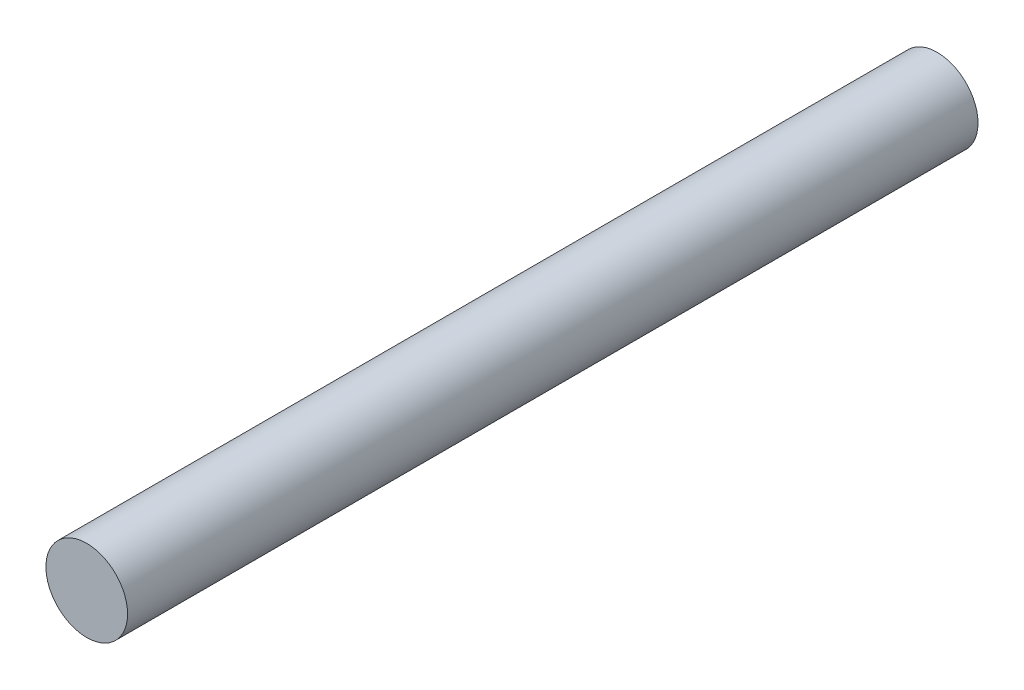
ISO-10303-21;
HEADER;
FILE_DESCRIPTION(('STEP AP214'),'2;1');
FILE_NAME('part.step','',(''),(''),'','','');
FILE_SCHEMA(('AUTOMOTIVE_DESIGN { 1 0 10303 214 1 1 1 1 }'));
ENDSEC;
DATA;
#1=APPLICATION_CONTEXT('core data for automotive mechanical design processes');
#2=APPLICATION_PROTOCOL_DEFINITION('international standard','automotive_design',2000,#1);
#3=PRODUCT_CONTEXT('',#1,'mechanical');
#4=PRODUCT('Part','Part','',(#3));
#5=PRODUCT_RELATED_PRODUCT_CATEGORY('part','',(#4));
#6=PRODUCT_DEFINITION_FORMATION('','',#4);
#7=PRODUCT_DEFINITION_CONTEXT('part definition',#1,'design');
#8=PRODUCT_DEFINITION('design','',#6,#7);
#9=PRODUCT_DEFINITION_SHAPE('','',#8);
#10=(LENGTH_UNIT() NAMED_UNIT(*) SI_UNIT(.MILLI.,.METRE.));
#11=(NAMED_UNIT(*) PLANE_ANGLE_UNIT() SI_UNIT($,.RADIAN.));
#12=(NAMED_UNIT(*) SI_UNIT($,.STERADIAN.) SOLID_ANGLE_UNIT());
#13=UNCERTAINTY_MEASURE_WITH_UNIT(LENGTH_MEASURE(1.E-05),#10,'distance_accuracy_value','');
#14=(GEOMETRIC_REPRESENTATION_CONTEXT(3) GLOBAL_UNCERTAINTY_ASSIGNED_CONTEXT((#13)) GLOBAL_UNIT_ASSIGNED_CONTEXT((#10,
#11,#12)) REPRESENTATION_CONTEXT('',''));
#15=CARTESIAN_POINT('',(0.,0.,0.));
#16=DIRECTION('',(0.,0.,1.));
#17=DIRECTION('',(1.,0.,0.));
#18=AXIS2_PLACEMENT_3D('',#15,#16,#17);
#19=CARTESIAN_POINT('',(0.,0.,500.));
#20=DIRECTION('',(0.,0.,-1.));
#21=DIRECTION('',(-1.,0.,0.));
#22=AXIS2_PLACEMENT_3D('',#19,#20,#21);
#23=CYLINDRICAL_SURFACE('',#22,24.);
#24=CARTESIAN_POINT('',(0.,0.,500.));
#25=DIRECTION('',(0.,0.,1.));
#26=DIRECTION('',(1.,0.,0.));
#27=AXIS2_PLACEMENT_3D('',#24,#25,#26);
#28=CIRCLE('',#27,24.);
#29=CARTESIAN_POINT('',(24.,0.,500.));
#30=VERTEX_POINT('',#29);
#31=EDGE_CURVE('E10',#30,#30,#28,.T.);
#32=ORIENTED_EDGE('',*,*,#31,.F.);
#33=EDGE_LOOP('',(#32));
#34=FACE_BOUND('',#33,.T.);
#35=CARTESIAN_POINT('',(0.,0.,0.));
#36=DIRECTION('',(0.,0.,1.));
#37=DIRECTION('',(1.,0.,0.));
#38=AXIS2_PLACEMENT_3D('',#35,#36,#37);
#39=CIRCLE('',#38,24.);
#40=CARTESIAN_POINT('',(24.,0.,0.));
#41=VERTEX_POINT('',#40);
#42=EDGE_CURVE('E33',#41,#41,#39,.T.);
#43=ORIENTED_EDGE('',*,*,#42,.T.);
#44=EDGE_LOOP('',(#43));
#45=FACE_BOUND('',#44,.T.);
#46=ADVANCED_FACE('F30',(#34,#45),#23,.T.);
#47=CARTESIAN_POINT('',(0.,0.,500.));
#48=DIRECTION('',(0.,0.,1.));
#49=DIRECTION('',(1.,0.,0.));
#50=AXIS2_PLACEMENT_3D('',#47,#48,#49);
#51=PLANE('',#50);
#52=ORIENTED_EDGE('',*,*,#31,.T.);
#53=EDGE_LOOP('',(#52));
#54=FACE_BOUND('',#53,.T.);
#55=ADVANCED_FACE('F45',(#54),#51,.T.);
#56=CARTESIAN_POINT('',(0.,0.,0.));
#57=DIRECTION('',(0.,0.,1.));
#58=DIRECTION('',(1.,0.,0.));
#59=AXIS2_PLACEMENT_3D('',#56,#57,#58);
#60=PLANE('',#59);
#61=ORIENTED_EDGE('',*,*,#42,.F.);
#62=EDGE_LOOP('',(#61));
#63=FACE_BOUND('',#62,.T.);
#64=ADVANCED_FACE('F43',(#63),#60,.F.);
#65=CLOSED_SHELL('',(#46,#55,#64));
#66=MANIFOLD_SOLID_BREP('B2',#65);
#67=ADVANCED_BREP_SHAPE_REPRESENTATION('',(#18,#66),#14);
#68=SHAPE_DEFINITION_REPRESENTATION(#9,#67);
ENDSEC;
END-ISO-10303-21;
